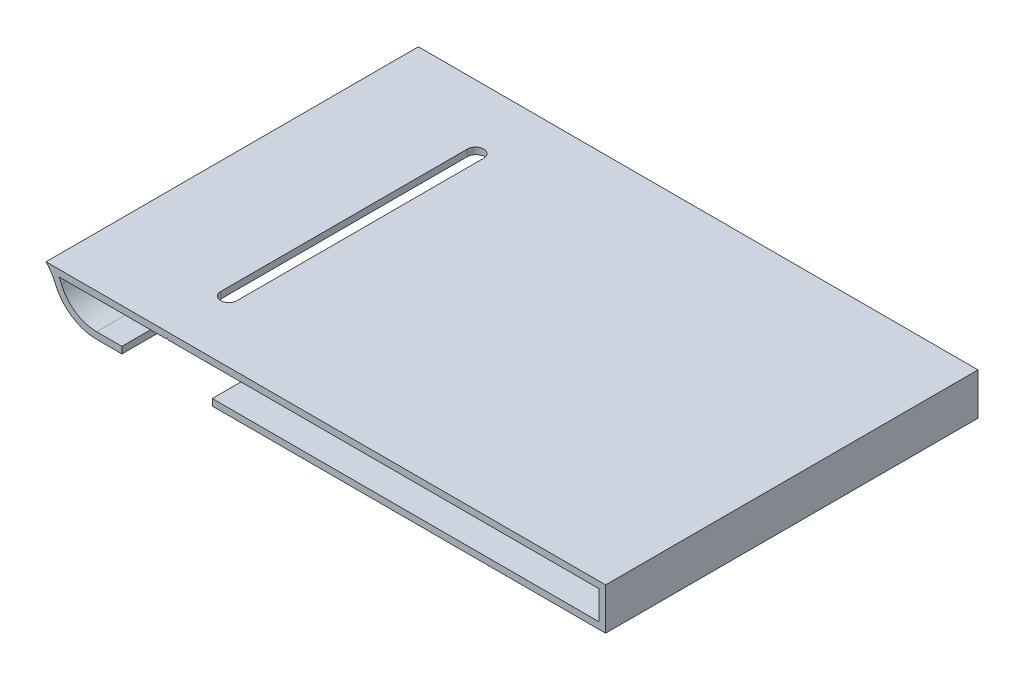
ISO-10303-21;
HEADER;
FILE_DESCRIPTION(('STEP AP214'),'2;1');
FILE_NAME('part.step','',(''),(''),'','','');
FILE_SCHEMA(('AUTOMOTIVE_DESIGN { 1 0 10303 214 1 1 1 1 }'));
ENDSEC;
DATA;
#1=APPLICATION_CONTEXT('core data for automotive mechanical design processes');
#2=APPLICATION_PROTOCOL_DEFINITION('international standard','automotive_design',2000,#1);
#3=PRODUCT_CONTEXT('',#1,'mechanical');
#4=PRODUCT('Part','Part','',(#3));
#5=PRODUCT_RELATED_PRODUCT_CATEGORY('part','',(#4));
#6=PRODUCT_DEFINITION_FORMATION('','',#4);
#7=PRODUCT_DEFINITION_CONTEXT('part definition',#1,'design');
#8=PRODUCT_DEFINITION('design','',#6,#7);
#9=PRODUCT_DEFINITION_SHAPE('','',#8);
#10=(LENGTH_UNIT() NAMED_UNIT(*) SI_UNIT(.MILLI.,.METRE.));
#11=(NAMED_UNIT(*) PLANE_ANGLE_UNIT() SI_UNIT($,.RADIAN.));
#12=(NAMED_UNIT(*) SI_UNIT($,.STERADIAN.) SOLID_ANGLE_UNIT());
#13=UNCERTAINTY_MEASURE_WITH_UNIT(LENGTH_MEASURE(1.E-05),#10,'distance_accuracy_value','');
#14=(GEOMETRIC_REPRESENTATION_CONTEXT(3) GLOBAL_UNCERTAINTY_ASSIGNED_CONTEXT((#13)) GLOBAL_UNIT_ASSIGNED_CONTEXT((#10,
#11,#12)) REPRESENTATION_CONTEXT('',''));
#15=CARTESIAN_POINT('',(0.,0.,0.));
#16=DIRECTION('',(0.,0.,1.));
#17=DIRECTION('',(1.,0.,0.));
#18=AXIS2_PLACEMENT_3D('',#15,#16,#17);
#19=CARTESIAN_POINT('',(-67.3,-102.,100.67082039325));
#20=DIRECTION('',(-0.707106781186531,0.707106781186564,0.));
#21=DIRECTION('',(-0.707106781186564,-0.707106781186531,0.));
#22=AXIS2_PLACEMENT_3D('',#19,#20,#21);
#23=PLANE('',#22);
#24=DIRECTION('',(0.,0.,-1.));
#25=VECTOR('',#24,1.);
#26=CARTESIAN_POINT('',(-67.3,-102.,100.67082039325));
#27=LINE('',#26,#25);
#28=CARTESIAN_POINT('',(-67.3,-102.,-241.5));
#29=VERTEX_POINT('',#28);
#30=CARTESIAN_POINT('',(-67.3,-102.,-253.699826397252));
#31=VERTEX_POINT('',#30);
#32=EDGE_CURVE('E251',#29,#31,#27,.T.);
#33=ORIENTED_EDGE('',*,*,#32,.T.);
#34=CARTESIAN_POINT('',(-67.,-101.7,-255.5));
#35=DIRECTION('',(-0.707106781186531,0.707106781186564,0.));
#36=DIRECTION('',(0.707106781186564,0.707106781186531,0.));
#37=AXIS2_PLACEMENT_3D('',#34,#35,#36);
#38=ELLIPSE('',#37,2.58093975134183,1.82500000000778);
#39=CARTESIAN_POINT('',(-67.,-101.7,-253.674999999992));
#40=VERTEX_POINT('',#39);
#41=EDGE_CURVE('E369',#31,#40,#38,.T.);
#42=ORIENTED_EDGE('',*,*,#41,.T.);
#43=DIRECTION('',(0.,0.,-1.));
#44=VECTOR('',#43,1.);
#45=CARTESIAN_POINT('',(-67.,-101.7,100.67082039325));
#46=LINE('',#45,#44);
#47=CARTESIAN_POINT('',(-67.,-101.7,-241.5));
#48=VERTEX_POINT('',#47);
#49=EDGE_CURVE('E248',#48,#40,#46,.T.);
#50=ORIENTED_EDGE('',*,*,#49,.F.);
#51=DIRECTION('',(0.707106781186564,0.707106781186531,0.));
#52=VECTOR('',#51,1.);
#53=CARTESIAN_POINT('',(17.3500000000015,-17.3500000000023,-241.5));
#54=LINE('',#53,#52);
#55=EDGE_CURVE('E257',#29,#48,#54,.T.);
#56=ORIENTED_EDGE('',*,*,#55,.F.);
#57=EDGE_LOOP('',(#33,#42,#50,#56));
#58=FACE_BOUND('',#57,.T.);
#59=ADVANCED_FACE('F35',(#58),#23,.F.);
#60=CARTESIAN_POINT('',(-67.,-101.7,100.67082039325));
#61=DIRECTION('',(0.707106781186531,0.707106781186564,0.));
#62=DIRECTION('',(-0.707106781186564,0.707106781186531,0.));
#63=AXIS2_PLACEMENT_3D('',#60,#61,#62);
#64=PLANE('',#63);
#65=ORIENTED_EDGE('',*,*,#49,.T.);
#66=CARTESIAN_POINT('',(-67.,-101.7,-255.5));
#67=DIRECTION('',(0.707106781186531,0.707106781186564,0.));
#68=DIRECTION('',(-0.707106781186564,0.707106781186531,0.));
#69=AXIS2_PLACEMENT_3D('',#66,#67,#68);
#70=ELLIPSE('',#69,2.58093975134185,1.82500000000778);
#71=CARTESIAN_POINT('',(-66.7,-102.,-253.699826397252));
#72=VERTEX_POINT('',#71);
#73=EDGE_CURVE('E362',#40,#72,#70,.T.);
#74=ORIENTED_EDGE('',*,*,#73,.T.);
#75=DIRECTION('',(0.,0.,-1.));
#76=VECTOR('',#75,1.);
#77=CARTESIAN_POINT('',(-66.7,-102.,100.67082039325));
#78=LINE('',#77,#76);
#79=CARTESIAN_POINT('',(-66.7,-102.,-241.5));
#80=VERTEX_POINT('',#79);
#81=EDGE_CURVE('E244',#80,#72,#78,.T.);
#82=ORIENTED_EDGE('',*,*,#81,.F.);
#83=DIRECTION('',(0.707106781186564,-0.707106781186531,0.));
#84=VECTOR('',#83,1.);
#85=CARTESIAN_POINT('',(-84.3499999999984,-84.3500000000023,-241.5));
#86=LINE('',#85,#84);
#87=EDGE_CURVE('E254',#48,#80,#86,.T.);
#88=ORIENTED_EDGE('',*,*,#87,.F.);
#89=EDGE_LOOP('',(#65,#74,#82,#88));
#90=FACE_BOUND('',#89,.T.);
#91=ADVANCED_FACE('F458',(#90),#64,.F.);
#92=CARTESIAN_POINT('',(0.,-110.,-421.5));
#93=DIRECTION('',(0.,1.,0.));
#94=DIRECTION('',(-1.,0.,0.));
#95=AXIS2_PLACEMENT_3D('',#92,#93,#94);
#96=PLANE('',#95);
#97=DIRECTION('',(-1.,0.,0.));
#98=VECTOR('',#97,1.);
#99=CARTESIAN_POINT('',(0.,-110.,-241.5));
#100=LINE('',#99,#98);
#101=CARTESIAN_POINT('',(32.5,-110.,-241.5));
#102=VERTEX_POINT('',#101);
#103=CARTESIAN_POINT('',(-56.75,-110.,-241.5));
#104=VERTEX_POINT('',#103);
#105=EDGE_CURVE('E290',#102,#104,#100,.T.);
#106=ORIENTED_EDGE('',*,*,#105,.T.);
#107=DIRECTION('',(0.,0.,-1.));
#108=VECTOR('',#107,1.);
#109=CARTESIAN_POINT('',(-56.75,-110.,-169.5));
#110=LINE('',#109,#108);
#111=CARTESIAN_POINT('',(-56.75,-110.,-326.));
#112=VERTEX_POINT('',#111);
#113=EDGE_CURVE('E220',#104,#112,#110,.T.);
#114=ORIENTED_EDGE('',*,*,#113,.T.);
#115=DIRECTION('',(1.,0.,0.));
#116=VECTOR('',#115,1.);
#117=CARTESIAN_POINT('',(-120.,-110.,-326.));
#118=LINE('',#117,#116);
#119=CARTESIAN_POINT('',(32.5,-110.,-326.));
#120=VERTEX_POINT('',#119);
#121=EDGE_CURVE('E260',#112,#120,#118,.T.);
#122=ORIENTED_EDGE('',*,*,#121,.T.);
#123=DIRECTION('',(0.,0.,1.));
#124=VECTOR('',#123,1.);
#125=CARTESIAN_POINT('',(32.5,-110.,-421.5));
#126=LINE('',#125,#124);
#127=EDGE_CURVE('E322',#120,#102,#126,.T.);
#128=ORIENTED_EDGE('',*,*,#127,.T.);
#129=EDGE_LOOP('',(#106,#114,#122,#128));
#130=FACE_BOUND('',#129,.T.);
#131=ADVANCED_FACE('F428',(#130),#96,.F.);
#132=CARTESIAN_POINT('',(0.,-108.5,-421.5));
#133=DIRECTION('',(0.,-1.,0.));
#134=DIRECTION('',(0.,0.,-1.));
#135=AXIS2_PLACEMENT_3D('',#132,#133,#134);
#136=PLANE('',#135);
#137=DIRECTION('',(1.,0.,0.));
#138=VECTOR('',#137,1.);
#139=CARTESIAN_POINT('',(0.,-108.5,-241.5));
#140=LINE('',#139,#138);
#141=CARTESIAN_POINT('',(-83.,-108.5,-241.5));
#142=VERTEX_POINT('',#141);
#143=CARTESIAN_POINT('',(-77.25,-108.5,-241.5));
#144=VERTEX_POINT('',#143);
#145=EDGE_CURVE('E319',#142,#144,#140,.T.);
#146=ORIENTED_EDGE('',*,*,#145,.T.);
#147=DIRECTION('',(0.,0.,-1.));
#148=VECTOR('',#147,1.);
#149=CARTESIAN_POINT('',(-77.25,-108.5,-421.5));
#150=LINE('',#149,#148);
#151=CARTESIAN_POINT('',(-77.25,-108.5,-326.));
#152=VERTEX_POINT('',#151);
#153=EDGE_CURVE('E237',#144,#152,#150,.T.);
#154=ORIENTED_EDGE('',*,*,#153,.T.);
#155=DIRECTION('',(-1.,0.,0.));
#156=VECTOR('',#155,1.);
#157=CARTESIAN_POINT('',(0.,-108.5,-326.));
#158=LINE('',#157,#156);
#159=CARTESIAN_POINT('',(-83.,-108.5,-326.));
#160=VERTEX_POINT('',#159);
#161=EDGE_CURVE('E336',#152,#160,#158,.T.);
#162=ORIENTED_EDGE('',*,*,#161,.T.);
#163=DIRECTION('',(0.,0.,1.));
#164=VECTOR('',#163,1.);
#165=CARTESIAN_POINT('',(-83.,-108.5,-421.5));
#166=LINE('',#165,#164);
#167=EDGE_CURVE('E326',#160,#142,#166,.T.);
#168=ORIENTED_EDGE('',*,*,#167,.T.);
#169=EDGE_LOOP('',(#146,#154,#162,#168));
#170=FACE_BOUND('',#169,.T.);
#171=ADVANCED_FACE('F405',(#170),#136,.F.);
#172=CARTESIAN_POINT('',(0.,-102.,-421.5));
#173=DIRECTION('',(0.,1.,0.));
#174=DIRECTION('',(0.,0.,1.));
#175=AXIS2_PLACEMENT_3D('',#172,#173,#174);
#176=PLANE('',#175);
#177=DIRECTION('',(0.,0.,1.));
#178=VECTOR('',#177,1.);
#179=CARTESIAN_POINT('',(-68.8250000000071,-102.,-421.5));
#180=LINE('',#179,#178);
#181=CARTESIAN_POINT('',(-68.8250000000078,-102.,-311.5));
#182=VERTEX_POINT('',#181);
#183=CARTESIAN_POINT('',(-68.8250000000071,-102.,-255.5));
#184=VERTEX_POINT('',#183);
#185=EDGE_CURVE('E216',#182,#184,#180,.T.);
#186=ORIENTED_EDGE('',*,*,#185,.T.);
#187=CARTESIAN_POINT('',(-67.,-102.,-255.5));
#188=DIRECTION('',(0.,1.,0.));
#189=DIRECTION('',(0.,0.,1.));
#190=AXIS2_PLACEMENT_3D('',#187,#188,#189);
#191=CIRCLE('',#190,1.82500000000778);
#192=EDGE_CURVE('E223',#184,#31,#191,.T.);
#193=ORIENTED_EDGE('',*,*,#192,.T.);
#194=ORIENTED_EDGE('',*,*,#32,.F.);
#195=DIRECTION('',(-1.,0.,0.));
#196=VECTOR('',#195,1.);
#197=CARTESIAN_POINT('',(0.,-102.,-241.5));
#198=LINE('',#197,#196);
#199=CARTESIAN_POINT('',(-91.5328115921768,-102.,-241.5));
#200=VERTEX_POINT('',#199);
#201=EDGE_CURVE('E308',#29,#200,#198,.T.);
#202=ORIENTED_EDGE('',*,*,#201,.T.);
#203=DIRECTION('',(0.,0.,1.));
#204=VECTOR('',#203,1.);
#205=CARTESIAN_POINT('',(-91.5328115921768,-102.,-421.5));
#206=LINE('',#205,#204);
#207=CARTESIAN_POINT('',(-91.5328115921768,-102.,-326.));
#208=VERTEX_POINT('',#207);
#209=EDGE_CURVE('E331',#208,#200,#206,.T.);
#210=ORIENTED_EDGE('',*,*,#209,.F.);
#211=DIRECTION('',(1.,0.,0.));
#212=VECTOR('',#211,1.);
#213=CARTESIAN_POINT('',(0.,-102.,-326.));
#214=LINE('',#213,#212);
#215=CARTESIAN_POINT('',(-67.3,-102.,-326.));
#216=VERTEX_POINT('',#215);
#217=EDGE_CURVE('E271',#208,#216,#214,.T.);
#218=ORIENTED_EDGE('',*,*,#217,.T.);
#219=CARTESIAN_POINT('',(-67.3,-102.,-313.300173602747));
#220=VERTEX_POINT('',#219);
#221=EDGE_CURVE('E246',#220,#216,#27,.T.);
#222=ORIENTED_EDGE('',*,*,#221,.F.);
#223=CARTESIAN_POINT('',(-67.,-102.,-311.5));
#224=DIRECTION('',(0.,1.,0.));
#225=DIRECTION('',(0.,0.,1.));
#226=AXIS2_PLACEMENT_3D('',#223,#224,#225);
#227=CIRCLE('',#226,1.82500000000778);
#228=EDGE_CURVE('E205',#220,#182,#227,.T.);
#229=ORIENTED_EDGE('',*,*,#228,.T.);
#230=EDGE_LOOP('',(#186,#193,#194,#202,#210,#218,#222,#229));
#231=FACE_BOUND('',#230,.T.);
#232=ADVANCED_FACE('F379',(#231),#176,.F.);
#233=CARTESIAN_POINT('',(31.,0.,-421.5));
#234=DIRECTION('',(1.,0.,0.));
#235=DIRECTION('',(0.,0.,-1.));
#236=AXIS2_PLACEMENT_3D('',#233,#234,#235);
#237=PLANE('',#236);
#238=DIRECTION('',(0.,0.,1.));
#239=VECTOR('',#238,1.);
#240=CARTESIAN_POINT('',(31.,-102.,-421.5));
#241=LINE('',#240,#239);
#242=CARTESIAN_POINT('',(31.,-102.,-326.));
#243=VERTEX_POINT('',#242);
#244=CARTESIAN_POINT('',(31.,-102.,-241.5));
#245=VERTEX_POINT('',#244);
#246=EDGE_CURVE('E334',#243,#245,#241,.T.);
#247=ORIENTED_EDGE('',*,*,#246,.F.);
#248=DIRECTION('',(0.,-1.,0.));
#249=VECTOR('',#248,1.);
#250=CARTESIAN_POINT('',(31.,0.,-326.));
#251=LINE('',#250,#249);
#252=CARTESIAN_POINT('',(31.,-108.5,-326.));
#253=VERTEX_POINT('',#252);
#254=EDGE_CURVE('E274',#243,#253,#251,.T.);
#255=ORIENTED_EDGE('',*,*,#254,.T.);
#256=DIRECTION('',(0.,0.,1.));
#257=VECTOR('',#256,1.);
#258=CARTESIAN_POINT('',(31.,-108.5,-421.5));
#259=LINE('',#258,#257);
#260=CARTESIAN_POINT('',(31.,-108.5,-241.5));
#261=VERTEX_POINT('',#260);
#262=EDGE_CURVE('E323',#253,#261,#259,.T.);
#263=ORIENTED_EDGE('',*,*,#262,.T.);
#264=DIRECTION('',(0.,1.,0.));
#265=VECTOR('',#264,1.);
#266=CARTESIAN_POINT('',(31.,0.,-241.5));
#267=LINE('',#266,#265);
#268=EDGE_CURVE('E305',#261,#245,#267,.T.);
#269=ORIENTED_EDGE('',*,*,#268,.T.);
#270=EDGE_LOOP('',(#247,#255,#263,#269));
#271=FACE_BOUND('',#270,.T.);
#272=ADVANCED_FACE('F438',(#271),#237,.F.);
#273=ORIENTED_EDGE('',*,*,#81,.T.);
#274=CARTESIAN_POINT('',(-67.,-102.,-255.5));
#275=DIRECTION('',(0.,1.,0.));
#276=DIRECTION('',(0.,0.,1.));
#277=AXIS2_PLACEMENT_3D('',#274,#275,#276);
#278=CIRCLE('',#277,1.82500000000778);
#279=CARTESIAN_POINT('',(-65.1749999999915,-102.,-255.5));
#280=VERTEX_POINT('',#279);
#281=EDGE_CURVE('E215',#72,#280,#278,.T.);
#282=ORIENTED_EDGE('',*,*,#281,.T.);
#283=DIRECTION('',(0.,0.,-1.));
#284=VECTOR('',#283,1.);
#285=CARTESIAN_POINT('',(-65.1749999999915,-102.,-421.5));
#286=LINE('',#285,#284);
#287=CARTESIAN_POINT('',(-65.1749999999915,-102.,-311.5));
#288=VERTEX_POINT('',#287);
#289=EDGE_CURVE('E208',#280,#288,#286,.T.);
#290=ORIENTED_EDGE('',*,*,#289,.T.);
#291=CARTESIAN_POINT('',(-67.,-102.,-311.5));
#292=DIRECTION('',(0.,1.,0.));
#293=DIRECTION('',(0.,0.,1.));
#294=AXIS2_PLACEMENT_3D('',#291,#292,#293);
#295=CIRCLE('',#294,1.82500000000778);
#296=CARTESIAN_POINT('',(-66.7,-102.,-313.300173602747));
#297=VERTEX_POINT('',#296);
#298=EDGE_CURVE('E195',#288,#297,#295,.T.);
#299=ORIENTED_EDGE('',*,*,#298,.T.);
#300=CARTESIAN_POINT('',(-66.7,-102.,-326.));
#301=VERTEX_POINT('',#300);
#302=EDGE_CURVE('E247',#297,#301,#78,.T.);
#303=ORIENTED_EDGE('',*,*,#302,.T.);
#304=EDGE_CURVE('E270',#301,#243,#214,.T.);
#305=ORIENTED_EDGE('',*,*,#304,.T.);
#306=ORIENTED_EDGE('',*,*,#246,.T.);
#307=EDGE_CURVE('E309',#245,#80,#198,.T.);
#308=ORIENTED_EDGE('',*,*,#307,.T.);
#309=EDGE_LOOP('',(#273,#282,#290,#299,#303,#305,#306,#308));
#310=FACE_BOUND('',#309,.T.);
#311=ADVANCED_FACE('F214',(#310),#176,.F.);
#312=CARTESIAN_POINT('',(-101.758107565017,-107.555793957317,-421.5));
#313=DIRECTION('',(0.,0.,1.));
#314=DIRECTION('',(1.,0.,0.));
#315=AXIS2_PLACEMENT_3D('',#312,#313,#314);
#316=CYLINDRICAL_SURFACE('',#315,11.6371613475259);
#317=DIRECTION('',(0.,0.,1.));
#318=VECTOR('',#317,1.);
#319=CARTESIAN_POINT('',(-90.9912312756488,-103.14015139957,-421.5));
#320=LINE('',#319,#318);
#321=CARTESIAN_POINT('',(-90.9912312756488,-103.14015139957,-326.));
#322=VERTEX_POINT('',#321);
#323=CARTESIAN_POINT('',(-90.9912312756488,-103.14015139957,-241.5));
#324=VERTEX_POINT('',#323);
#325=EDGE_CURVE('E329',#322,#324,#320,.T.);
#326=ORIENTED_EDGE('',*,*,#325,.F.);
#327=CARTESIAN_POINT('',(-101.758107565017,-107.555793957317,-326.));
#328=DIRECTION('',(0.,0.,1.));
#329=DIRECTION('',(1.,0.,0.));
#330=AXIS2_PLACEMENT_3D('',#327,#328,#329);
#331=CIRCLE('',#330,11.6371613475259);
#332=EDGE_CURVE('E267',#322,#208,#331,.T.);
#333=ORIENTED_EDGE('',*,*,#332,.T.);
#334=ORIENTED_EDGE('',*,*,#209,.T.);
#335=CARTESIAN_POINT('',(-101.758107565017,-107.555793957317,-241.5));
#336=DIRECTION('',(0.,0.,-1.));
#337=DIRECTION('',(-1.,0.,0.));
#338=AXIS2_PLACEMENT_3D('',#335,#336,#337);
#339=CIRCLE('',#338,11.6371613475259);
#340=EDGE_CURVE('E312',#200,#324,#339,.T.);
#341=ORIENTED_EDGE('',*,*,#340,.T.);
#342=EDGE_LOOP('',(#326,#333,#334,#341));
#343=FACE_BOUND('',#342,.T.);
#344=ADVANCED_FACE('F395',(#343),#316,.T.);
#345=CARTESIAN_POINT('',(-83.,-99.8628386524749,-421.5));
#346=DIRECTION('',(0.,0.,1.));
#347=DIRECTION('',(1.,0.,0.));
#348=AXIS2_PLACEMENT_3D('',#345,#346,#347);
#349=CYLINDRICAL_SURFACE('',#348,8.63716134752514);
#350=ORIENTED_EDGE('',*,*,#167,.F.);
#351=CARTESIAN_POINT('',(-83.,-99.8628386524749,-326.));
#352=DIRECTION('',(0.,0.,1.));
#353=DIRECTION('',(1.,0.,0.));
#354=AXIS2_PLACEMENT_3D('',#351,#352,#353);
#355=CIRCLE('',#354,8.63716134752514);
#356=EDGE_CURVE('E264',#160,#322,#355,.F.);
#357=ORIENTED_EDGE('',*,*,#356,.T.);
#358=ORIENTED_EDGE('',*,*,#325,.T.);
#359=CARTESIAN_POINT('',(-83.,-99.8628386524749,-241.5));
#360=DIRECTION('',(0.,0.,-1.));
#361=DIRECTION('',(-1.,0.,0.));
#362=AXIS2_PLACEMENT_3D('',#359,#360,#361);
#363=CIRCLE('',#362,8.63716134752514);
#364=EDGE_CURVE('E315',#324,#142,#363,.F.);
#365=ORIENTED_EDGE('',*,*,#364,.T.);
#366=EDGE_LOOP('',(#350,#357,#358,#365));
#367=FACE_BOUND('',#366,.T.);
#368=ADVANCED_FACE('F402',(#367),#349,.F.);
#369=CARTESIAN_POINT('',(-83.,-110.,-326.));
#370=VERTEX_POINT('',#369);
#371=CARTESIAN_POINT('',(-77.25,-110.,-326.));
#372=VERTEX_POINT('',#371);
#373=EDGE_CURVE('E261',#370,#372,#118,.T.);
#374=ORIENTED_EDGE('',*,*,#373,.T.);
#375=DIRECTION('',(0.,0.,-1.));
#376=VECTOR('',#375,1.);
#377=CARTESIAN_POINT('',(-77.25,-110.,-169.5));
#378=LINE('',#377,#376);
#379=CARTESIAN_POINT('',(-77.25,-110.,-241.5));
#380=VERTEX_POINT('',#379);
#381=EDGE_CURVE('E227',#380,#372,#378,.T.);
#382=ORIENTED_EDGE('',*,*,#381,.F.);
#383=CARTESIAN_POINT('',(-83.,-110.,-241.5));
#384=VERTEX_POINT('',#383);
#385=EDGE_CURVE('E289',#380,#384,#100,.T.);
#386=ORIENTED_EDGE('',*,*,#385,.T.);
#387=DIRECTION('',(0.,0.,1.));
#388=VECTOR('',#387,1.);
#389=CARTESIAN_POINT('',(-83.,-110.,-421.5));
#390=LINE('',#389,#388);
#391=EDGE_CURVE('E327',#370,#384,#390,.T.);
#392=ORIENTED_EDGE('',*,*,#391,.F.);
#393=EDGE_LOOP('',(#374,#382,#386,#392));
#394=FACE_BOUND('',#393,.T.);
#395=ADVANCED_FACE('F37',(#394),#96,.F.);
#396=CARTESIAN_POINT('',(-83.,-99.8628386524749,-421.5));
#397=DIRECTION('',(0.,0.,1.));
#398=DIRECTION('',(1.,0.,0.));
#399=AXIS2_PLACEMENT_3D('',#396,#397,#398);
#400=CYLINDRICAL_SURFACE('',#399,10.1371613475251);
#401=DIRECTION('',(0.,0.,1.));
#402=VECTOR('',#401,1.);
#403=CARTESIAN_POINT('',(-92.3790537825084,-103.709316304896,-421.5));
#404=LINE('',#403,#402);
#405=CARTESIAN_POINT('',(-92.3790537825084,-103.709316304896,-326.));
#406=VERTEX_POINT('',#405);
#407=CARTESIAN_POINT('',(-92.3790537825084,-103.709316304896,-241.5));
#408=VERTEX_POINT('',#407);
#409=EDGE_CURVE('E342',#406,#408,#404,.T.);
#410=ORIENTED_EDGE('',*,*,#409,.F.);
#411=CARTESIAN_POINT('',(-83.,-99.8628386524749,-326.));
#412=DIRECTION('',(0.,0.,1.));
#413=DIRECTION('',(1.,0.,0.));
#414=AXIS2_PLACEMENT_3D('',#411,#412,#413);
#415=CIRCLE('',#414,10.1371613475251);
#416=EDGE_CURVE('E286',#406,#370,#415,.T.);
#417=ORIENTED_EDGE('',*,*,#416,.T.);
#418=ORIENTED_EDGE('',*,*,#391,.T.);
#419=CARTESIAN_POINT('',(-83.,-99.8628386524749,-241.5));
#420=DIRECTION('',(0.,0.,-1.));
#421=DIRECTION('',(-1.,0.,0.));
#422=AXIS2_PLACEMENT_3D('',#419,#420,#421);
#423=CIRCLE('',#422,10.1371613475251);
#424=EDGE_CURVE('E293',#384,#408,#423,.T.);
#425=ORIENTED_EDGE('',*,*,#424,.T.);
#426=EDGE_LOOP('',(#410,#417,#418,#425));
#427=FACE_BOUND('',#426,.T.);
#428=ADVANCED_FACE('F413',(#427),#400,.T.);
#429=CARTESIAN_POINT('',(-101.758107565017,-107.555793957317,-421.5));
#430=DIRECTION('',(0.,0.,1.));
#431=DIRECTION('',(1.,0.,0.));
#432=AXIS2_PLACEMENT_3D('',#429,#430,#431);
#433=CYLINDRICAL_SURFACE('',#432,10.1371613475259);
#434=DIRECTION('',(0.,0.,1.));
#435=VECTOR('',#434,1.);
#436=CARTESIAN_POINT('',(-94.479521725882,-100.5,-421.5));
#437=LINE('',#436,#435);
#438=CARTESIAN_POINT('',(-94.479521725882,-100.5,-326.));
#439=VERTEX_POINT('',#438);
#440=CARTESIAN_POINT('',(-94.479521725882,-100.5,-241.5));
#441=VERTEX_POINT('',#440);
#442=EDGE_CURVE('E340',#439,#441,#437,.T.);
#443=ORIENTED_EDGE('',*,*,#442,.F.);
#444=CARTESIAN_POINT('',(-101.758107565017,-107.555793957317,-326.));
#445=DIRECTION('',(0.,0.,1.));
#446=DIRECTION('',(1.,0.,0.));
#447=AXIS2_PLACEMENT_3D('',#444,#445,#446);
#448=CIRCLE('',#447,10.1371613475259);
#449=EDGE_CURVE('E283',#439,#406,#448,.F.);
#450=ORIENTED_EDGE('',*,*,#449,.T.);
#451=ORIENTED_EDGE('',*,*,#409,.T.);
#452=CARTESIAN_POINT('',(-101.758107565017,-107.555793957317,-241.5));
#453=DIRECTION('',(0.,0.,-1.));
#454=DIRECTION('',(-1.,0.,0.));
#455=AXIS2_PLACEMENT_3D('',#452,#453,#454);
#456=CIRCLE('',#455,10.1371613475259);
#457=EDGE_CURVE('E296',#408,#441,#456,.F.);
#458=ORIENTED_EDGE('',*,*,#457,.T.);
#459=EDGE_LOOP('',(#443,#450,#451,#458));
#460=FACE_BOUND('',#459,.T.);
#461=ADVANCED_FACE('F419',(#460),#433,.F.);
#462=CARTESIAN_POINT('',(0.,-100.5,-421.5));
#463=DIRECTION('',(0.,-1.,0.));
#464=DIRECTION('',(1.,0.,0.));
#465=AXIS2_PLACEMENT_3D('',#462,#463,#464);
#466=PLANE('',#465);
#467=DIRECTION('',(0.,0.,1.));
#468=VECTOR('',#467,1.);
#469=CARTESIAN_POINT('',(-65.1749999999915,-100.5,-421.5));
#470=LINE('',#469,#468);
#471=CARTESIAN_POINT('',(-65.1749999999915,-100.5,-311.5));
#472=VERTEX_POINT('',#471);
#473=CARTESIAN_POINT('',(-65.1749999999915,-100.5,-255.5));
#474=VERTEX_POINT('',#473);
#475=EDGE_CURVE('E43',#472,#474,#470,.T.);
#476=ORIENTED_EDGE('',*,*,#475,.T.);
#477=CARTESIAN_POINT('',(-67.,-100.5,-255.5));
#478=DIRECTION('',(0.,-1.,0.));
#479=DIRECTION('',(1.,0.,0.));
#480=AXIS2_PLACEMENT_3D('',#477,#478,#479);
#481=CIRCLE('',#480,1.82500000000778);
#482=CARTESIAN_POINT('',(-68.8250000000071,-100.5,-255.5));
#483=VERTEX_POINT('',#482);
#484=EDGE_CURVE('E217',#474,#483,#481,.T.);
#485=ORIENTED_EDGE('',*,*,#484,.T.);
#486=DIRECTION('',(0.,0.,-1.));
#487=VECTOR('',#486,1.);
#488=CARTESIAN_POINT('',(-68.8250000000071,-100.5,-421.5));
#489=LINE('',#488,#487);
#490=CARTESIAN_POINT('',(-68.8250000000078,-100.5,-311.5));
#491=VERTEX_POINT('',#490);
#492=EDGE_CURVE('E11',#483,#491,#489,.T.);
#493=ORIENTED_EDGE('',*,*,#492,.T.);
#494=CARTESIAN_POINT('',(-67.,-100.5,-311.5));
#495=DIRECTION('',(0.,-1.,0.));
#496=DIRECTION('',(1.,0.,0.));
#497=AXIS2_PLACEMENT_3D('',#494,#495,#496);
#498=CIRCLE('',#497,1.82500000000778);
#499=EDGE_CURVE('E367',#491,#472,#498,.T.);
#500=ORIENTED_EDGE('',*,*,#499,.T.);
#501=EDGE_LOOP('',(#476,#485,#493,#500));
#502=FACE_BOUND('',#501,.T.);
#503=DIRECTION('',(0.,0.,1.));
#504=VECTOR('',#503,1.);
#505=CARTESIAN_POINT('',(32.5,-100.5,-421.5));
#506=LINE('',#505,#504);
#507=CARTESIAN_POINT('',(32.5,-100.5,-326.));
#508=VERTEX_POINT('',#507);
#509=CARTESIAN_POINT('',(32.5,-100.5,-241.5));
#510=VERTEX_POINT('',#509);
#511=EDGE_CURVE('E338',#508,#510,#506,.T.);
#512=ORIENTED_EDGE('',*,*,#511,.F.);
#513=DIRECTION('',(-1.,0.,0.));
#514=VECTOR('',#513,1.);
#515=CARTESIAN_POINT('',(0.,-100.5,-326.));
#516=LINE('',#515,#514);
#517=EDGE_CURVE('E280',#508,#439,#516,.T.);
#518=ORIENTED_EDGE('',*,*,#517,.T.);
#519=ORIENTED_EDGE('',*,*,#442,.T.);
#520=DIRECTION('',(1.,0.,0.));
#521=VECTOR('',#520,1.);
#522=CARTESIAN_POINT('',(0.,-100.5,-241.5));
#523=LINE('',#522,#521);
#524=EDGE_CURVE('E299',#441,#510,#523,.T.);
#525=ORIENTED_EDGE('',*,*,#524,.T.);
#526=EDGE_LOOP('',(#512,#518,#519,#525));
#527=FACE_BOUND('',#526,.T.);
#528=ADVANCED_FACE('F365',(#502,#527),#466,.F.);
#529=CARTESIAN_POINT('',(32.5,0.,-421.5));
#530=DIRECTION('',(-1.,0.,0.));
#531=DIRECTION('',(0.,-1.,0.));
#532=AXIS2_PLACEMENT_3D('',#529,#530,#531);
#533=PLANE('',#532);
#534=ORIENTED_EDGE('',*,*,#127,.F.);
#535=DIRECTION('',(0.,1.,0.));
#536=VECTOR('',#535,1.);
#537=CARTESIAN_POINT('',(32.5,0.,-326.));
#538=LINE('',#537,#536);
#539=EDGE_CURVE('E277',#120,#508,#538,.T.);
#540=ORIENTED_EDGE('',*,*,#539,.T.);
#541=ORIENTED_EDGE('',*,*,#511,.T.);
#542=DIRECTION('',(0.,-1.,0.));
#543=VECTOR('',#542,1.);
#544=CARTESIAN_POINT('',(32.5,0.,-241.5));
#545=LINE('',#544,#543);
#546=EDGE_CURVE('E302',#510,#102,#545,.T.);
#547=ORIENTED_EDGE('',*,*,#546,.T.);
#548=EDGE_LOOP('',(#534,#540,#541,#547));
#549=FACE_BOUND('',#548,.T.);
#550=ADVANCED_FACE('F424',(#549),#533,.F.);
#551=CARTESIAN_POINT('',(-56.75,-108.5,-326.));
#552=VERTEX_POINT('',#551);
#553=EDGE_CURVE('E346',#253,#552,#158,.T.);
#554=ORIENTED_EDGE('',*,*,#553,.T.);
#555=DIRECTION('',(0.,0.,1.));
#556=VECTOR('',#555,1.);
#557=CARTESIAN_POINT('',(-56.75,-108.5,-421.5));
#558=LINE('',#557,#556);
#559=CARTESIAN_POINT('',(-56.75,-108.5,-241.5));
#560=VERTEX_POINT('',#559);
#561=EDGE_CURVE('E229',#552,#560,#558,.T.);
#562=ORIENTED_EDGE('',*,*,#561,.T.);
#563=EDGE_CURVE('E318',#560,#261,#140,.T.);
#564=ORIENTED_EDGE('',*,*,#563,.T.);
#565=ORIENTED_EDGE('',*,*,#262,.F.);
#566=EDGE_LOOP('',(#554,#562,#564,#565));
#567=FACE_BOUND('',#566,.T.);
#568=ADVANCED_FACE('F435',(#567),#136,.F.);
#569=CARTESIAN_POINT('',(0.,0.,-241.5));
#570=DIRECTION('',(0.,0.,-1.));
#571=DIRECTION('',(-1.,0.,0.));
#572=AXIS2_PLACEMENT_3D('',#569,#570,#571);
#573=PLANE('',#572);
#574=ORIENTED_EDGE('',*,*,#385,.F.);
#575=DIRECTION('',(0.,1.,0.));
#576=VECTOR('',#575,1.);
#577=CARTESIAN_POINT('',(-77.25,0.,-241.5));
#578=LINE('',#577,#576);
#579=EDGE_CURVE('E240',#380,#144,#578,.T.);
#580=ORIENTED_EDGE('',*,*,#579,.T.);
#581=ORIENTED_EDGE('',*,*,#145,.F.);
#582=ORIENTED_EDGE('',*,*,#364,.F.);
#583=ORIENTED_EDGE('',*,*,#340,.F.);
#584=ORIENTED_EDGE('',*,*,#201,.F.);
#585=ORIENTED_EDGE('',*,*,#55,.T.);
#586=ORIENTED_EDGE('',*,*,#87,.T.);
#587=ORIENTED_EDGE('',*,*,#307,.F.);
#588=ORIENTED_EDGE('',*,*,#268,.F.);
#589=ORIENTED_EDGE('',*,*,#563,.F.);
#590=DIRECTION('',(0.,-1.,0.));
#591=VECTOR('',#590,1.);
#592=CARTESIAN_POINT('',(-56.75,0.,-241.5));
#593=LINE('',#592,#591);
#594=EDGE_CURVE('E234',#560,#104,#593,.T.);
#595=ORIENTED_EDGE('',*,*,#594,.T.);
#596=ORIENTED_EDGE('',*,*,#105,.F.);
#597=ORIENTED_EDGE('',*,*,#546,.F.);
#598=ORIENTED_EDGE('',*,*,#524,.F.);
#599=ORIENTED_EDGE('',*,*,#457,.F.);
#600=ORIENTED_EDGE('',*,*,#424,.F.);
#601=EDGE_LOOP('',(#574,#580,#581,#582,#583,#584,#585,#586,#587,#588,#589,#595,#596,#597,#598,
#599,#600));
#602=FACE_BOUND('',#601,.T.);
#603=ADVANCED_FACE('F388',(#602),#573,.F.);
#604=CARTESIAN_POINT('',(-120.,-110.,-326.));
#605=DIRECTION('',(0.,0.,1.));
#606=DIRECTION('',(1.,0.,0.));
#607=AXIS2_PLACEMENT_3D('',#604,#605,#606);
#608=PLANE('',#607);
#609=ORIENTED_EDGE('',*,*,#161,.F.);
#610=DIRECTION('',(0.,-1.,0.));
#611=VECTOR('',#610,1.);
#612=CARTESIAN_POINT('',(-77.25,-110.,-326.));
#613=LINE('',#612,#611);
#614=EDGE_CURVE('E358',#152,#372,#613,.T.);
#615=ORIENTED_EDGE('',*,*,#614,.T.);
#616=ORIENTED_EDGE('',*,*,#373,.F.);
#617=ORIENTED_EDGE('',*,*,#416,.F.);
#618=ORIENTED_EDGE('',*,*,#449,.F.);
#619=ORIENTED_EDGE('',*,*,#517,.F.);
#620=ORIENTED_EDGE('',*,*,#539,.F.);
#621=ORIENTED_EDGE('',*,*,#121,.F.);
#622=DIRECTION('',(0.,1.,0.));
#623=VECTOR('',#622,1.);
#624=CARTESIAN_POINT('',(-56.75,-110.,-326.));
#625=LINE('',#624,#623);
#626=EDGE_CURVE('E355',#112,#552,#625,.T.);
#627=ORIENTED_EDGE('',*,*,#626,.T.);
#628=ORIENTED_EDGE('',*,*,#553,.F.);
#629=ORIENTED_EDGE('',*,*,#254,.F.);
#630=ORIENTED_EDGE('',*,*,#304,.F.);
#631=DIRECTION('',(-0.707106781186564,0.707106781186531,0.));
#632=VECTOR('',#631,1.);
#633=CARTESIAN_POINT('',(-89.3500000000012,-79.3499999999999,-326.));
#634=LINE('',#633,#632);
#635=CARTESIAN_POINT('',(-67.,-101.7,-326.));
#636=VERTEX_POINT('',#635);
#637=EDGE_CURVE('E349',#301,#636,#634,.T.);
#638=ORIENTED_EDGE('',*,*,#637,.T.);
#639=DIRECTION('',(-0.707106781186564,-0.707106781186531,0.));
#640=VECTOR('',#639,1.);
#641=CARTESIAN_POINT('',(-97.6500000000013,-132.35,-326.));
#642=LINE('',#641,#640);
#643=EDGE_CURVE('E352',#636,#216,#642,.T.);
#644=ORIENTED_EDGE('',*,*,#643,.T.);
#645=ORIENTED_EDGE('',*,*,#217,.F.);
#646=ORIENTED_EDGE('',*,*,#332,.F.);
#647=ORIENTED_EDGE('',*,*,#356,.F.);
#648=EDGE_LOOP('',(#609,#615,#616,#617,#618,#619,#620,#621,#627,#628,#629,#630,#638,#644,#645,
#646,#647));
#649=FACE_BOUND('',#648,.T.);
#650=ADVANCED_FACE('F399',(#649),#608,.F.);
#651=CARTESIAN_POINT('',(-67.,-101.7,-313.325000000008));
#652=VERTEX_POINT('',#651);
#653=EDGE_CURVE('E243',#652,#636,#46,.T.);
#654=ORIENTED_EDGE('',*,*,#653,.F.);
#655=CARTESIAN_POINT('',(-67.,-101.7,-311.5));
#656=DIRECTION('',(-0.707106781186531,0.707106781186564,0.));
#657=DIRECTION('',(0.707106781186564,0.707106781186531,0.));
#658=AXIS2_PLACEMENT_3D('',#655,#656,#657);
#659=ELLIPSE('',#658,2.58093975134183,1.82500000000778);
#660=EDGE_CURVE('E58',#652,#220,#659,.T.);
#661=ORIENTED_EDGE('',*,*,#660,.T.);
#662=ORIENTED_EDGE('',*,*,#221,.T.);
#663=ORIENTED_EDGE('',*,*,#643,.F.);
#664=EDGE_LOOP('',(#654,#661,#662,#663));
#665=FACE_BOUND('',#664,.T.);
#666=ADVANCED_FACE('F447',(#665),#23,.F.);
#667=ORIENTED_EDGE('',*,*,#302,.F.);
#668=CARTESIAN_POINT('',(-67.,-101.7,-311.5));
#669=DIRECTION('',(0.707106781186531,0.707106781186564,0.));
#670=DIRECTION('',(-0.707106781186564,0.707106781186531,0.));
#671=AXIS2_PLACEMENT_3D('',#668,#669,#670);
#672=ELLIPSE('',#671,2.58093975134185,1.82500000000778);
#673=EDGE_CURVE('E201',#297,#652,#672,.T.);
#674=ORIENTED_EDGE('',*,*,#673,.T.);
#675=ORIENTED_EDGE('',*,*,#653,.T.);
#676=ORIENTED_EDGE('',*,*,#637,.F.);
#677=EDGE_LOOP('',(#667,#674,#675,#676));
#678=FACE_BOUND('',#677,.T.);
#679=ADVANCED_FACE('F443',(#678),#64,.F.);
#680=CARTESIAN_POINT('',(-56.75,-110.,-169.5));
#681=DIRECTION('',(1.,0.,0.));
#682=DIRECTION('',(0.,0.,-1.));
#683=AXIS2_PLACEMENT_3D('',#680,#681,#682);
#684=PLANE('',#683);
#685=ORIENTED_EDGE('',*,*,#561,.F.);
#686=ORIENTED_EDGE('',*,*,#626,.F.);
#687=ORIENTED_EDGE('',*,*,#113,.F.);
#688=ORIENTED_EDGE('',*,*,#594,.F.);
#689=EDGE_LOOP('',(#685,#686,#687,#688));
#690=FACE_BOUND('',#689,.T.);
#691=ADVANCED_FACE('F430',(#690),#684,.F.);
#692=CARTESIAN_POINT('',(-77.25,-110.,-169.5));
#693=DIRECTION('',(-1.,0.,0.));
#694=DIRECTION('',(0.,0.,1.));
#695=AXIS2_PLACEMENT_3D('',#692,#693,#694);
#696=PLANE('',#695);
#697=ORIENTED_EDGE('',*,*,#381,.T.);
#698=ORIENTED_EDGE('',*,*,#614,.F.);
#699=ORIENTED_EDGE('',*,*,#153,.F.);
#700=ORIENTED_EDGE('',*,*,#579,.F.);
#701=EDGE_LOOP('',(#697,#698,#699,#700));
#702=FACE_BOUND('',#701,.T.);
#703=ADVANCED_FACE('F472',(#702),#696,.F.);
#704=CARTESIAN_POINT('',(-68.8250000000071,-110.000000000002,-311.5));
#705=DIRECTION('',(-1.,0.,0.));
#706=DIRECTION('',(0.,-1.,0.));
#707=AXIS2_PLACEMENT_3D('',#704,#705,#706);
#708=PLANE('',#707);
#709=DIRECTION('',(0.,1.,0.));
#710=VECTOR('',#709,1.);
#711=CARTESIAN_POINT('',(-68.8250000000077,-110.000000000002,-311.5));
#712=LINE('',#711,#710);
#713=EDGE_CURVE('E210',#182,#491,#712,.T.);
#714=ORIENTED_EDGE('',*,*,#713,.T.);
#715=ORIENTED_EDGE('',*,*,#492,.F.);
#716=DIRECTION('',(0.,1.,0.));
#717=VECTOR('',#716,1.);
#718=CARTESIAN_POINT('',(-68.8250000000071,-110.000000000002,-255.5));
#719=LINE('',#718,#717);
#720=EDGE_CURVE('E449',#184,#483,#719,.T.);
#721=ORIENTED_EDGE('',*,*,#720,.F.);
#722=ORIENTED_EDGE('',*,*,#185,.F.);
#723=EDGE_LOOP('',(#714,#715,#721,#722));
#724=FACE_BOUND('',#723,.T.);
#725=ADVANCED_FACE('F455',(#724),#708,.F.);
#726=CARTESIAN_POINT('',(-65.1749999999915,-110.000000000002,-255.5));
#727=DIRECTION('',(1.,0.,0.));
#728=DIRECTION('',(0.,1.,0.));
#729=AXIS2_PLACEMENT_3D('',#726,#727,#728);
#730=PLANE('',#729);
#731=DIRECTION('',(0.,1.,0.));
#732=VECTOR('',#731,1.);
#733=CARTESIAN_POINT('',(-65.1749999999915,-110.000000000002,-255.5));
#734=LINE('',#733,#732);
#735=EDGE_CURVE('E50',#280,#474,#734,.T.);
#736=ORIENTED_EDGE('',*,*,#735,.T.);
#737=ORIENTED_EDGE('',*,*,#475,.F.);
#738=DIRECTION('',(0.,1.,0.));
#739=VECTOR('',#738,1.);
#740=CARTESIAN_POINT('',(-65.1749999999915,-110.000000000002,-311.5));
#741=LINE('',#740,#739);
#742=EDGE_CURVE('E199',#288,#472,#741,.T.);
#743=ORIENTED_EDGE('',*,*,#742,.F.);
#744=ORIENTED_EDGE('',*,*,#289,.F.);
#745=EDGE_LOOP('',(#736,#737,#743,#744));
#746=FACE_BOUND('',#745,.T.);
#747=ADVANCED_FACE('F207',(#746),#730,.F.);
#748=CARTESIAN_POINT('',(-66.9999999999999,-110.000000000002,-255.5));
#749=DIRECTION('',(0.,1.,0.));
#750=DIRECTION('',(-1.,0.,0.));
#751=AXIS2_PLACEMENT_3D('',#748,#749,#750);
#752=CYLINDRICAL_SURFACE('',#751,1.82500000000778);
#753=ORIENTED_EDGE('',*,*,#735,.F.);
#754=ORIENTED_EDGE('',*,*,#281,.F.);
#755=ORIENTED_EDGE('',*,*,#73,.F.);
#756=ORIENTED_EDGE('',*,*,#41,.F.);
#757=ORIENTED_EDGE('',*,*,#192,.F.);
#758=ORIENTED_EDGE('',*,*,#720,.T.);
#759=ORIENTED_EDGE('',*,*,#484,.F.);
#760=EDGE_LOOP('',(#753,#754,#755,#756,#757,#758,#759));
#761=FACE_BOUND('',#760,.T.);
#762=ADVANCED_FACE('F456',(#761),#752,.F.);
#763=CARTESIAN_POINT('',(-66.9999999999999,-110.000000000002,-311.5));
#764=DIRECTION('',(0.,1.,0.));
#765=DIRECTION('',(-1.,0.,0.));
#766=AXIS2_PLACEMENT_3D('',#763,#764,#765);
#767=CYLINDRICAL_SURFACE('',#766,1.82500000000778);
#768=ORIENTED_EDGE('',*,*,#713,.F.);
#769=ORIENTED_EDGE('',*,*,#228,.F.);
#770=ORIENTED_EDGE('',*,*,#660,.F.);
#771=ORIENTED_EDGE('',*,*,#673,.F.);
#772=ORIENTED_EDGE('',*,*,#298,.F.);
#773=ORIENTED_EDGE('',*,*,#742,.T.);
#774=ORIENTED_EDGE('',*,*,#499,.F.);
#775=EDGE_LOOP('',(#768,#769,#770,#771,#772,#773,#774));
#776=FACE_BOUND('',#775,.T.);
#777=ADVANCED_FACE('F198',(#776),#767,.F.);
#778=CLOSED_SHELL('',(#59,#91,#131,#171,#232,#272,#311,#344,#368,#395,#428,#461,#528,#550,#568,
#603,#650,#666,#679,#691,#703,#725,#747,#762,#777));
#779=MANIFOLD_SOLID_BREP('B2',#778);
#780=ADVANCED_BREP_SHAPE_REPRESENTATION('',(#18,#779),#14);
#781=SHAPE_DEFINITION_REPRESENTATION(#9,#780);
ENDSEC;
END-ISO-10303-21;
